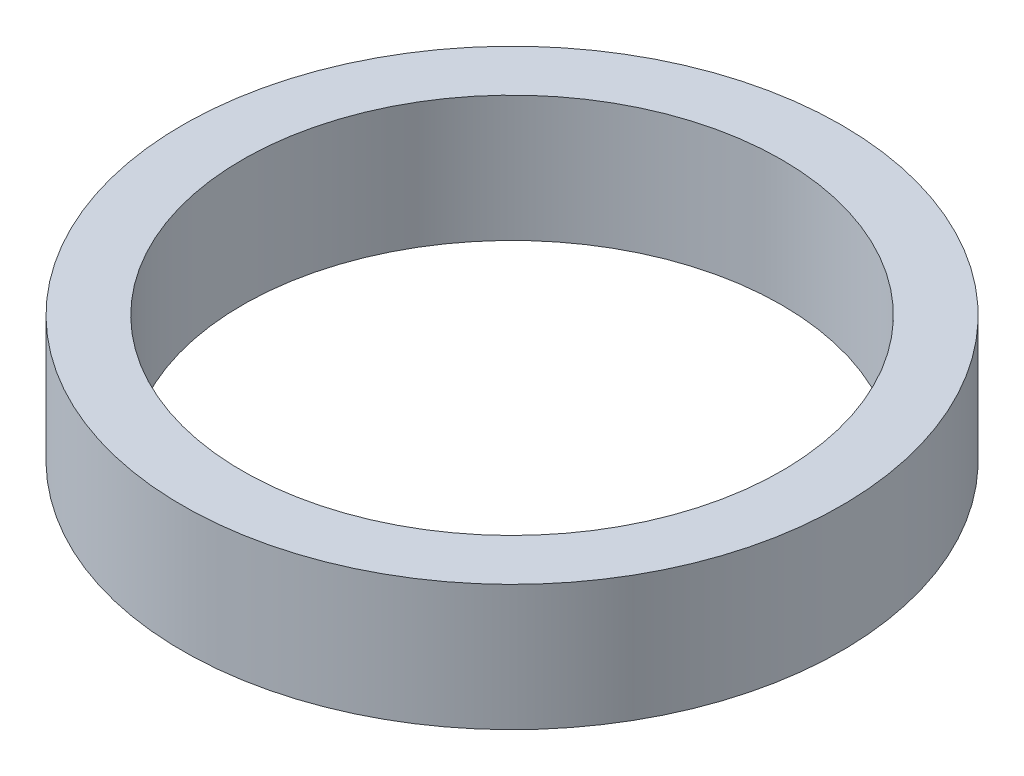
ISO-10303-21;
HEADER;
FILE_DESCRIPTION(('STEP AP214'),'2;1');
FILE_NAME('part.step','',(''),(''),'','','');
FILE_SCHEMA(('AUTOMOTIVE_DESIGN { 1 0 10303 214 1 1 1 1 }'));
ENDSEC;
DATA;
#1=APPLICATION_CONTEXT('core data for automotive mechanical design processes');
#2=APPLICATION_PROTOCOL_DEFINITION('international standard','automotive_design',2000,#1);
#3=PRODUCT_CONTEXT('',#1,'mechanical');
#4=PRODUCT('Part','Part','',(#3));
#5=PRODUCT_RELATED_PRODUCT_CATEGORY('part','',(#4));
#6=PRODUCT_DEFINITION_FORMATION('','',#4);
#7=PRODUCT_DEFINITION_CONTEXT('part definition',#1,'design');
#8=PRODUCT_DEFINITION('design','',#6,#7);
#9=PRODUCT_DEFINITION_SHAPE('','',#8);
#10=(LENGTH_UNIT() NAMED_UNIT(*) SI_UNIT(.MILLI.,.METRE.));
#11=(NAMED_UNIT(*) PLANE_ANGLE_UNIT() SI_UNIT($,.RADIAN.));
#12=(NAMED_UNIT(*) SI_UNIT($,.STERADIAN.) SOLID_ANGLE_UNIT());
#13=UNCERTAINTY_MEASURE_WITH_UNIT(LENGTH_MEASURE(1.E-05),#10,'distance_accuracy_value','');
#14=(GEOMETRIC_REPRESENTATION_CONTEXT(3) GLOBAL_UNCERTAINTY_ASSIGNED_CONTEXT((#13)) GLOBAL_UNIT_ASSIGNED_CONTEXT((#10,
#11,#12)) REPRESENTATION_CONTEXT('',''));
#15=CARTESIAN_POINT('',(0.,0.,0.));
#16=DIRECTION('',(0.,0.,1.));
#17=DIRECTION('',(1.,0.,0.));
#18=AXIS2_PLACEMENT_3D('',#15,#16,#17);
#19=CARTESIAN_POINT('',(0.,21.,0.));
#20=DIRECTION('',(0.,-1.,0.));
#21=DIRECTION('',(0.,0.,-1.));
#22=AXIS2_PLACEMENT_3D('',#19,#20,#21);
#23=CYLINDRICAL_SURFACE('',#22,55.);
#24=CARTESIAN_POINT('',(0.,21.,0.));
#25=DIRECTION('',(0.,1.,0.));
#26=DIRECTION('',(0.,0.,1.));
#27=AXIS2_PLACEMENT_3D('',#24,#25,#26);
#28=CIRCLE('',#27,55.);
#29=CARTESIAN_POINT('',(0.,21.,-55.));
#30=VERTEX_POINT('',#29);
#31=EDGE_CURVE('E10',#30,#30,#28,.T.);
#32=CARTESIAN_POINT('',(0.,0.,0.));
#33=DIRECTION('',(0.,1.,0.));
#34=DIRECTION('',(0.,0.,1.));
#35=AXIS2_PLACEMENT_3D('',#32,#33,#34);
#36=CIRCLE('',#35,55.);
#37=CARTESIAN_POINT('',(0.,0.,-55.));
#38=VERTEX_POINT('',#37);
#39=EDGE_CURVE('E37',#38,#38,#36,.T.);
#40=CARTESIAN_POINT('',(0.,21.,-55.));
#41=CARTESIAN_POINT('',(0.,20.78125,-55.));
#42=CARTESIAN_POINT('',(0.,20.5625,-55.));
#43=CARTESIAN_POINT('',(0.,20.125,-55.));
#44=CARTESIAN_POINT('',(0.,19.90625,-55.));
#45=CARTESIAN_POINT('',(0.,19.46875,-55.));
#46=CARTESIAN_POINT('',(0.,19.25,-55.));
#47=CARTESIAN_POINT('',(0.,18.8125,-55.));
#48=CARTESIAN_POINT('',(0.,18.59375,-55.));
#49=CARTESIAN_POINT('',(0.,18.15625,-55.));
#50=CARTESIAN_POINT('',(0.,17.9375,-55.));
#51=CARTESIAN_POINT('',(0.,17.5,-55.));
#52=CARTESIAN_POINT('',(0.,17.28125,-55.));
#53=CARTESIAN_POINT('',(0.,16.84375,-55.));
#54=CARTESIAN_POINT('',(0.,16.625,-55.));
#55=CARTESIAN_POINT('',(0.,16.1875,-55.));
#56=CARTESIAN_POINT('',(0.,15.96875,-55.));
#57=CARTESIAN_POINT('',(0.,15.53125,-55.));
#58=CARTESIAN_POINT('',(0.,15.3125,-55.));
#59=CARTESIAN_POINT('',(0.,14.875,-55.));
#60=CARTESIAN_POINT('',(0.,14.65625,-55.));
#61=CARTESIAN_POINT('',(0.,14.21875,-55.));
#62=CARTESIAN_POINT('',(0.,14.,-55.));
#63=CARTESIAN_POINT('',(0.,13.5625,-55.));
#64=CARTESIAN_POINT('',(0.,13.34375,-55.));
#65=CARTESIAN_POINT('',(0.,12.90625,-55.));
#66=CARTESIAN_POINT('',(0.,12.6875,-55.));
#67=CARTESIAN_POINT('',(0.,12.25,-55.));
#68=CARTESIAN_POINT('',(0.,12.03125,-55.));
#69=CARTESIAN_POINT('',(0.,11.59375,-55.));
#70=CARTESIAN_POINT('',(0.,11.375,-55.));
#71=CARTESIAN_POINT('',(0.,10.9375,-55.));
#72=CARTESIAN_POINT('',(0.,10.71875,-55.));
#73=CARTESIAN_POINT('',(0.,10.28125,-55.));
#74=CARTESIAN_POINT('',(0.,10.0625,-55.));
#75=CARTESIAN_POINT('',(0.,9.625,-55.));
#76=CARTESIAN_POINT('',(0.,9.40625,-55.));
#77=CARTESIAN_POINT('',(0.,8.96875,-55.));
#78=CARTESIAN_POINT('',(0.,8.75,-55.));
#79=CARTESIAN_POINT('',(0.,8.3125,-55.));
#80=CARTESIAN_POINT('',(0.,8.09375,-55.));
#81=CARTESIAN_POINT('',(0.,7.65625,-55.));
#82=CARTESIAN_POINT('',(0.,7.4375,-55.));
#83=CARTESIAN_POINT('',(0.,7.,-55.));
#84=CARTESIAN_POINT('',(0.,6.78125,-55.));
#85=CARTESIAN_POINT('',(0.,6.34375,-55.));
#86=CARTESIAN_POINT('',(0.,6.125,-55.));
#87=CARTESIAN_POINT('',(0.,5.6875,-55.));
#88=CARTESIAN_POINT('',(0.,5.46875,-55.));
#89=CARTESIAN_POINT('',(0.,5.03125,-55.));
#90=CARTESIAN_POINT('',(0.,4.8125,-55.));
#91=CARTESIAN_POINT('',(0.,4.375,-55.));
#92=CARTESIAN_POINT('',(0.,4.15625,-55.));
#93=CARTESIAN_POINT('',(0.,3.71875,-55.));
#94=CARTESIAN_POINT('',(0.,3.5,-55.));
#95=CARTESIAN_POINT('',(0.,3.0625,-55.));
#96=CARTESIAN_POINT('',(0.,2.84375,-55.));
#97=CARTESIAN_POINT('',(0.,2.40625,-55.));
#98=CARTESIAN_POINT('',(0.,2.1875,-55.));
#99=CARTESIAN_POINT('',(0.,1.75,-55.));
#100=CARTESIAN_POINT('',(0.,1.53125,-55.));
#101=CARTESIAN_POINT('',(0.,1.09375,-55.));
#102=CARTESIAN_POINT('',(0.,0.875000000000001,-55.));
#103=CARTESIAN_POINT('',(0.,0.4375,-55.));
#104=CARTESIAN_POINT('',(0.,0.21875,-55.));
#105=CARTESIAN_POINT('',(0.,0.,-55.));
#106=B_SPLINE_CURVE_WITH_KNOTS('',3,(#40,#41,#42,#43,#44,#45,#46,#47,#48,#49,#50,#51,#52,#53,
#54,#55,#56,#57,#58,#59,#60,#61,#62,#63,#64,#65,#66,#67,#68,#69,#70,#71,#72,#73,#74,#75,#76,#77,
#78,#79,#80,#81,#82,#83,#84,#85,#86,#87,#88,#89,#90,#91,#92,#93,#94,#95,#96,#97,#98,#99,#100,
#101,#102,#103,#104,#105),.UNSPECIFIED.,.F.,.F.,(4,2,2,2,2,2,2,2,2,2,2,2,2,2,2,2,2,2,2,2,2,2,2,
2,2,2,2,2,2,2,2,2,4),(0.,0.656250000000001,1.3125,1.96875,2.625,3.28125,3.9375,4.59375,5.25,
5.90625,6.5625,7.21875,7.875,8.53125,9.1875,9.84375,10.5,11.15625,11.8125,12.46875,13.125,
13.78125,14.4375,15.09375,15.75,16.40625,17.0625,17.71875,18.375,19.03125,19.6875,20.34375,21.),.UNSPECIFIED.);
#107=EDGE_CURVE('BSEAM40',#30,#38,#106,.T.);
#108=ORIENTED_EDGE('',*,*,#31,.F.);
#109=ORIENTED_EDGE('',*,*,#39,.T.);
#110=ORIENTED_EDGE('',*,*,#107,.T.);
#111=ORIENTED_EDGE('',*,*,#107,.F.);
#112=EDGE_LOOP('',(#108,#110,#109,#111));
#113=FACE_BOUND('',#112,.T.);
#114=ADVANCED_FACE('F40',(#113),#23,.T.);
#115=CARTESIAN_POINT('',(0.,21.,0.));
#116=DIRECTION('',(0.,1.,0.));
#117=DIRECTION('',(0.,0.,1.));
#118=AXIS2_PLACEMENT_3D('',#115,#116,#117);
#119=PLANE('',#118);
#120=CARTESIAN_POINT('',(0.,21.,0.));
#121=DIRECTION('',(0.,1.,0.));
#122=DIRECTION('',(0.,0.,1.));
#123=AXIS2_PLACEMENT_3D('',#120,#121,#122);
#124=CIRCLE('',#123,45.);
#125=CARTESIAN_POINT('',(0.,21.,-45.));
#126=VERTEX_POINT('',#125);
#127=EDGE_CURVE('E50',#126,#126,#124,.T.);
#128=ORIENTED_EDGE('',*,*,#127,.F.);
#129=EDGE_LOOP('',(#128));
#130=FACE_BOUND('',#129,.T.);
#131=ORIENTED_EDGE('',*,*,#31,.T.);
#132=EDGE_LOOP('',(#131));
#133=FACE_BOUND('',#132,.T.);
#134=ADVANCED_FACE('F59',(#130,#133),#119,.T.);
#135=CARTESIAN_POINT('',(0.,0.,0.));
#136=DIRECTION('',(0.,1.,0.));
#137=DIRECTION('',(0.,0.,1.));
#138=AXIS2_PLACEMENT_3D('',#135,#136,#137);
#139=PLANE('',#138);
#140=CARTESIAN_POINT('',(0.,0.,0.));
#141=DIRECTION('',(0.,1.,0.));
#142=DIRECTION('',(0.,0.,1.));
#143=AXIS2_PLACEMENT_3D('',#140,#141,#142);
#144=CIRCLE('',#143,45.);
#145=CARTESIAN_POINT('',(0.,0.,-45.));
#146=VERTEX_POINT('',#145);
#147=EDGE_CURVE('E47',#146,#146,#144,.T.);
#148=ORIENTED_EDGE('',*,*,#147,.T.);
#149=EDGE_LOOP('',(#148));
#150=FACE_BOUND('',#149,.T.);
#151=ORIENTED_EDGE('',*,*,#39,.F.);
#152=EDGE_LOOP('',(#151));
#153=FACE_BOUND('',#152,.T.);
#154=ADVANCED_FACE('F58',(#150,#153),#139,.F.);
#155=CARTESIAN_POINT('',(0.,21.,0.));
#156=DIRECTION('',(0.,-1.,0.));
#157=DIRECTION('',(0.,0.,-1.));
#158=AXIS2_PLACEMENT_3D('',#155,#156,#157);
#159=CYLINDRICAL_SURFACE('',#158,45.);
#160=CARTESIAN_POINT('',(0.,21.,-45.));
#161=CARTESIAN_POINT('',(0.,20.78125,-45.));
#162=CARTESIAN_POINT('',(0.,20.5625,-45.));
#163=CARTESIAN_POINT('',(0.,20.125,-45.));
#164=CARTESIAN_POINT('',(0.,19.90625,-45.));
#165=CARTESIAN_POINT('',(0.,19.46875,-45.));
#166=CARTESIAN_POINT('',(0.,19.25,-45.));
#167=CARTESIAN_POINT('',(0.,18.8125,-45.));
#168=CARTESIAN_POINT('',(0.,18.59375,-45.));
#169=CARTESIAN_POINT('',(0.,18.15625,-45.));
#170=CARTESIAN_POINT('',(0.,17.9375,-45.));
#171=CARTESIAN_POINT('',(0.,17.5,-45.));
#172=CARTESIAN_POINT('',(0.,17.28125,-45.));
#173=CARTESIAN_POINT('',(0.,16.84375,-45.));
#174=CARTESIAN_POINT('',(0.,16.625,-45.));
#175=CARTESIAN_POINT('',(0.,16.1875,-45.));
#176=CARTESIAN_POINT('',(0.,15.96875,-45.));
#177=CARTESIAN_POINT('',(0.,15.53125,-45.));
#178=CARTESIAN_POINT('',(0.,15.3125,-45.));
#179=CARTESIAN_POINT('',(0.,14.875,-45.));
#180=CARTESIAN_POINT('',(0.,14.65625,-45.));
#181=CARTESIAN_POINT('',(0.,14.21875,-45.));
#182=CARTESIAN_POINT('',(0.,14.,-45.));
#183=CARTESIAN_POINT('',(0.,13.5625,-45.));
#184=CARTESIAN_POINT('',(0.,13.34375,-45.));
#185=CARTESIAN_POINT('',(0.,12.90625,-45.));
#186=CARTESIAN_POINT('',(0.,12.6875,-45.));
#187=CARTESIAN_POINT('',(0.,12.25,-45.));
#188=CARTESIAN_POINT('',(0.,12.03125,-45.));
#189=CARTESIAN_POINT('',(0.,11.59375,-45.));
#190=CARTESIAN_POINT('',(0.,11.375,-45.));
#191=CARTESIAN_POINT('',(0.,10.9375,-45.));
#192=CARTESIAN_POINT('',(0.,10.71875,-45.));
#193=CARTESIAN_POINT('',(0.,10.28125,-45.));
#194=CARTESIAN_POINT('',(0.,10.0625,-45.));
#195=CARTESIAN_POINT('',(0.,9.625,-45.));
#196=CARTESIAN_POINT('',(0.,9.40625,-45.));
#197=CARTESIAN_POINT('',(0.,8.96875,-45.));
#198=CARTESIAN_POINT('',(0.,8.75,-45.));
#199=CARTESIAN_POINT('',(0.,8.3125,-45.));
#200=CARTESIAN_POINT('',(0.,8.09375,-45.));
#201=CARTESIAN_POINT('',(0.,7.65625,-45.));
#202=CARTESIAN_POINT('',(0.,7.4375,-45.));
#203=CARTESIAN_POINT('',(0.,7.,-45.));
#204=CARTESIAN_POINT('',(0.,6.78125,-45.));
#205=CARTESIAN_POINT('',(0.,6.34375,-45.));
#206=CARTESIAN_POINT('',(0.,6.125,-45.));
#207=CARTESIAN_POINT('',(0.,5.6875,-45.));
#208=CARTESIAN_POINT('',(0.,5.46875,-45.));
#209=CARTESIAN_POINT('',(0.,5.03125,-45.));
#210=CARTESIAN_POINT('',(0.,4.8125,-45.));
#211=CARTESIAN_POINT('',(0.,4.375,-45.));
#212=CARTESIAN_POINT('',(0.,4.15625,-45.));
#213=CARTESIAN_POINT('',(0.,3.71875,-45.));
#214=CARTESIAN_POINT('',(0.,3.5,-45.));
#215=CARTESIAN_POINT('',(0.,3.0625,-45.));
#216=CARTESIAN_POINT('',(0.,2.84375,-45.));
#217=CARTESIAN_POINT('',(0.,2.40625,-45.));
#218=CARTESIAN_POINT('',(0.,2.1875,-45.));
#219=CARTESIAN_POINT('',(0.,1.75,-45.));
#220=CARTESIAN_POINT('',(0.,1.53125,-45.));
#221=CARTESIAN_POINT('',(0.,1.09375,-45.));
#222=CARTESIAN_POINT('',(0.,0.875000000000001,-45.));
#223=CARTESIAN_POINT('',(0.,0.4375,-45.));
#224=CARTESIAN_POINT('',(0.,0.21875,-45.));
#225=CARTESIAN_POINT('',(0.,0.,-45.));
#226=B_SPLINE_CURVE_WITH_KNOTS('',3,(#160,#161,#162,#163,#164,#165,#166,#167,#168,#169,#170,
#171,#172,#173,#174,#175,#176,#177,#178,#179,#180,#181,#182,#183,#184,#185,#186,#187,#188,#189,
#190,#191,#192,#193,#194,#195,#196,#197,#198,#199,#200,#201,#202,#203,#204,#205,#206,#207,#208,
#209,#210,#211,#212,#213,#214,#215,#216,#217,#218,#219,#220,#221,#222,#223,#224,#225),
.UNSPECIFIED.,.F.,.F.,(4,2,2,2,2,2,2,2,2,2,2,2,2,2,2,2,2,2,2,2,2,2,2,2,2,2,2,2,2,2,2,2,4),(0.,
0.656250000000001,1.3125,1.96875,2.625,3.28125,3.9375,4.59375,5.25,5.90625,6.5625,7.21875,7.875,
8.53125,9.1875,9.84375,10.5,11.15625,11.8125,12.46875,13.125,13.78125,14.4375,15.09375,15.75,
16.40625,17.0625,17.71875,18.375,19.03125,19.6875,20.34375,21.),.UNSPECIFIED.);
#227=EDGE_CURVE('BSEAM54',#126,#146,#226,.T.);
#228=ORIENTED_EDGE('',*,*,#127,.T.);
#229=ORIENTED_EDGE('',*,*,#147,.F.);
#230=ORIENTED_EDGE('',*,*,#227,.T.);
#231=ORIENTED_EDGE('',*,*,#227,.F.);
#232=EDGE_LOOP('',(#228,#230,#229,#231));
#233=FACE_BOUND('',#232,.T.);
#234=ADVANCED_FACE('F54',(#233),#159,.F.);
#235=CLOSED_SHELL('',(#114,#134,#154,#234));
#236=MANIFOLD_SOLID_BREP('B2',#235);
#237=ADVANCED_BREP_SHAPE_REPRESENTATION('',(#18,#236),#14);
#238=SHAPE_DEFINITION_REPRESENTATION(#9,#237);
ENDSEC;
END-ISO-10303-21;
